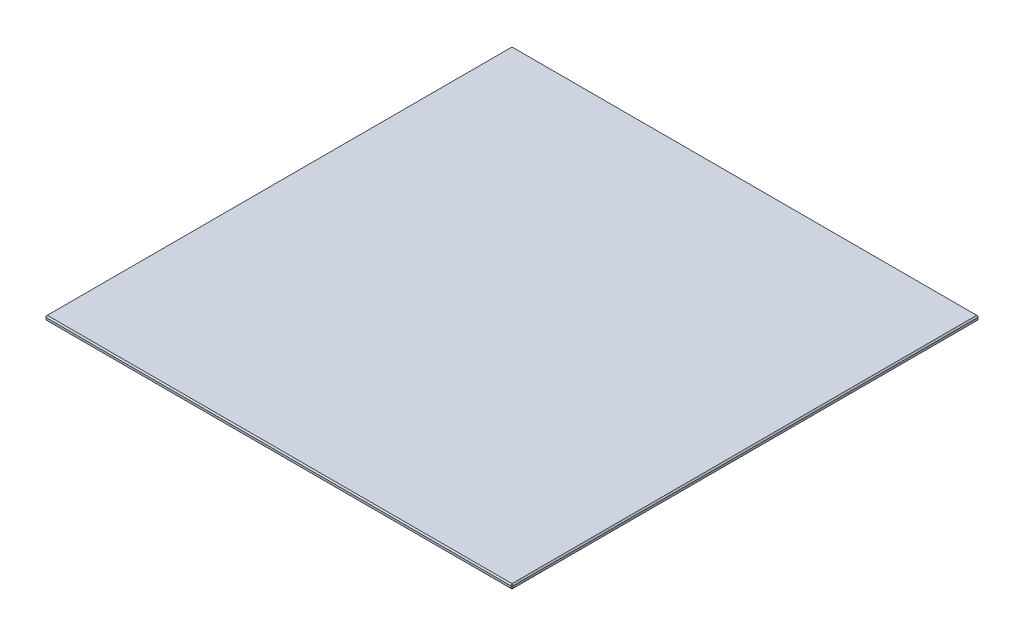
ISO-10303-21;
HEADER;
FILE_DESCRIPTION(('STEP AP214'),'2;1');
FILE_NAME('part.step','',(''),(''),'','','');
FILE_SCHEMA(('AUTOMOTIVE_DESIGN { 1 0 10303 214 1 1 1 1 }'));
ENDSEC;
DATA;
#1=APPLICATION_CONTEXT('core data for automotive mechanical design processes');
#2=APPLICATION_PROTOCOL_DEFINITION('international standard','automotive_design',2000,#1);
#3=PRODUCT_CONTEXT('',#1,'mechanical');
#4=PRODUCT('Part','Part','',(#3));
#5=PRODUCT_RELATED_PRODUCT_CATEGORY('part','',(#4));
#6=PRODUCT_DEFINITION_FORMATION('','',#4);
#7=PRODUCT_DEFINITION_CONTEXT('part definition',#1,'design');
#8=PRODUCT_DEFINITION('design','',#6,#7);
#9=PRODUCT_DEFINITION_SHAPE('','',#8);
#10=(LENGTH_UNIT() NAMED_UNIT(*) SI_UNIT(.MILLI.,.METRE.));
#11=(NAMED_UNIT(*) PLANE_ANGLE_UNIT() SI_UNIT($,.RADIAN.));
#12=(NAMED_UNIT(*) SI_UNIT($,.STERADIAN.) SOLID_ANGLE_UNIT());
#13=UNCERTAINTY_MEASURE_WITH_UNIT(LENGTH_MEASURE(1.E-05),#10,'distance_accuracy_value','');
#14=(GEOMETRIC_REPRESENTATION_CONTEXT(3) GLOBAL_UNCERTAINTY_ASSIGNED_CONTEXT((#13)) GLOBAL_UNIT_ASSIGNED_CONTEXT((#10,
#11,#12)) REPRESENTATION_CONTEXT('',''));
#15=CARTESIAN_POINT('',(0.,0.,0.));
#16=DIRECTION('',(0.,0.,1.));
#17=DIRECTION('',(1.,0.,0.));
#18=AXIS2_PLACEMENT_3D('',#15,#16,#17);
#19=CARTESIAN_POINT('',(-150.,3.,-150.));
#20=DIRECTION('',(1.,0.,0.));
#21=DIRECTION('',(0.,0.,-1.));
#22=AXIS2_PLACEMENT_3D('',#19,#20,#21);
#23=PLANE('',#22);
#24=DIRECTION('',(0.,0.,-1.));
#25=VECTOR('',#24,1.);
#26=CARTESIAN_POINT('',(-150.,2.19999999999998,-150.));
#27=LINE('',#26,#25);
#28=CARTESIAN_POINT('',(-150.,2.19999999999998,149.2));
#29=VERTEX_POINT('',#28);
#30=CARTESIAN_POINT('',(-150.,2.19999999999998,-149.2));
#31=VERTEX_POINT('',#30);
#32=EDGE_CURVE('E216',#29,#31,#27,.T.);
#33=ORIENTED_EDGE('',*,*,#32,.T.);
#34=DIRECTION('',(0.,-1.,0.));
#35=VECTOR('',#34,1.);
#36=CARTESIAN_POINT('',(-150.,3.,-149.2));
#37=LINE('',#36,#35);
#38=CARTESIAN_POINT('',(-150.,0.800000000000023,-149.2));
#39=VERTEX_POINT('',#38);
#40=EDGE_CURVE('E11',#31,#39,#37,.T.);
#41=ORIENTED_EDGE('',*,*,#40,.T.);
#42=DIRECTION('',(0.,0.,1.));
#43=VECTOR('',#42,1.);
#44=CARTESIAN_POINT('',(-150.,0.800000000000023,-150.));
#45=LINE('',#44,#43);
#46=CARTESIAN_POINT('',(-150.,0.800000000000023,149.2));
#47=VERTEX_POINT('',#46);
#48=EDGE_CURVE('E43',#39,#47,#45,.T.);
#49=ORIENTED_EDGE('',*,*,#48,.T.);
#50=DIRECTION('',(0.,1.,0.));
#51=VECTOR('',#50,1.);
#52=CARTESIAN_POINT('',(-150.,3.,149.2));
#53=LINE('',#52,#51);
#54=EDGE_CURVE('E241',#47,#29,#53,.T.);
#55=ORIENTED_EDGE('',*,*,#54,.T.);
#56=EDGE_LOOP('',(#33,#41,#49,#55));
#57=FACE_BOUND('',#56,.T.);
#58=ADVANCED_FACE('F34',(#57),#23,.F.);
#59=CARTESIAN_POINT('',(-150.,3.,150.));
#60=DIRECTION('',(0.,0.,-1.));
#61=DIRECTION('',(-1.,0.,0.));
#62=AXIS2_PLACEMENT_3D('',#59,#60,#61);
#63=PLANE('',#62);
#64=DIRECTION('',(1.,0.,0.));
#65=VECTOR('',#64,1.);
#66=CARTESIAN_POINT('',(-150.,0.800000000000023,150.));
#67=LINE('',#66,#65);
#68=CARTESIAN_POINT('',(-149.2,0.800000000000023,150.));
#69=VERTEX_POINT('',#68);
#70=CARTESIAN_POINT('',(149.2,0.800000000000023,150.));
#71=VERTEX_POINT('',#70);
#72=EDGE_CURVE('E275',#69,#71,#67,.T.);
#73=ORIENTED_EDGE('',*,*,#72,.T.);
#74=DIRECTION('',(0.,1.,0.));
#75=VECTOR('',#74,1.);
#76=CARTESIAN_POINT('',(149.2,3.,150.));
#77=LINE('',#76,#75);
#78=CARTESIAN_POINT('',(149.2,2.19999999999998,150.));
#79=VERTEX_POINT('',#78);
#80=EDGE_CURVE('E272',#71,#79,#77,.T.);
#81=ORIENTED_EDGE('',*,*,#80,.T.);
#82=DIRECTION('',(-1.,0.,0.));
#83=VECTOR('',#82,1.);
#84=CARTESIAN_POINT('',(-150.,2.19999999999998,150.));
#85=LINE('',#84,#83);
#86=CARTESIAN_POINT('',(-149.2,2.19999999999998,150.));
#87=VERTEX_POINT('',#86);
#88=EDGE_CURVE('E264',#79,#87,#85,.T.);
#89=ORIENTED_EDGE('',*,*,#88,.T.);
#90=DIRECTION('',(0.,-1.,0.));
#91=VECTOR('',#90,1.);
#92=CARTESIAN_POINT('',(-149.2,3.,150.));
#93=LINE('',#92,#91);
#94=EDGE_CURVE('E269',#87,#69,#93,.T.);
#95=ORIENTED_EDGE('',*,*,#94,.T.);
#96=EDGE_LOOP('',(#73,#81,#89,#95));
#97=FACE_BOUND('',#96,.T.);
#98=ADVANCED_FACE('F273',(#97),#63,.F.);
#99=CARTESIAN_POINT('',(150.,3.,-150.));
#100=DIRECTION('',(-1.,0.,0.));
#101=DIRECTION('',(0.,0.,1.));
#102=AXIS2_PLACEMENT_3D('',#99,#100,#101);
#103=PLANE('',#102);
#104=DIRECTION('',(0.,0.,1.));
#105=VECTOR('',#104,1.);
#106=CARTESIAN_POINT('',(150.,2.19999999999998,150.));
#107=LINE('',#106,#105);
#108=CARTESIAN_POINT('',(150.,2.19999999999998,-149.2));
#109=VERTEX_POINT('',#108);
#110=CARTESIAN_POINT('',(150.,2.19999999999998,149.2));
#111=VERTEX_POINT('',#110);
#112=EDGE_CURVE('E133',#109,#111,#107,.T.);
#113=ORIENTED_EDGE('',*,*,#112,.T.);
#114=DIRECTION('',(0.,-1.,0.));
#115=VECTOR('',#114,1.);
#116=CARTESIAN_POINT('',(150.,3.,149.2));
#117=LINE('',#116,#115);
#118=CARTESIAN_POINT('',(150.,0.800000000000023,149.2));
#119=VERTEX_POINT('',#118);
#120=EDGE_CURVE('E129',#111,#119,#117,.T.);
#121=ORIENTED_EDGE('',*,*,#120,.T.);
#122=DIRECTION('',(0.,0.,-1.));
#123=VECTOR('',#122,1.);
#124=CARTESIAN_POINT('',(150.,0.800000000000023,-150.));
#125=LINE('',#124,#123);
#126=CARTESIAN_POINT('',(150.,0.800000000000023,-149.2));
#127=VERTEX_POINT('',#126);
#128=EDGE_CURVE('E123',#119,#127,#125,.T.);
#129=ORIENTED_EDGE('',*,*,#128,.T.);
#130=DIRECTION('',(0.,1.,0.));
#131=VECTOR('',#130,1.);
#132=CARTESIAN_POINT('',(150.,3.,-149.2));
#133=LINE('',#132,#131);
#134=EDGE_CURVE('E126',#127,#109,#133,.T.);
#135=ORIENTED_EDGE('',*,*,#134,.T.);
#136=EDGE_LOOP('',(#113,#121,#129,#135));
#137=FACE_BOUND('',#136,.T.);
#138=ADVANCED_FACE('F125',(#137),#103,.F.);
#139=CARTESIAN_POINT('',(-150.,3.,-150.));
#140=DIRECTION('',(0.,0.,1.));
#141=DIRECTION('',(1.,0.,0.));
#142=AXIS2_PLACEMENT_3D('',#139,#140,#141);
#143=PLANE('',#142);
#144=DIRECTION('',(1.,0.,0.));
#145=VECTOR('',#144,1.);
#146=CARTESIAN_POINT('',(150.,2.19999999999998,-150.));
#147=LINE('',#146,#145);
#148=CARTESIAN_POINT('',(-149.2,2.19999999999998,-150.));
#149=VERTEX_POINT('',#148);
#150=CARTESIAN_POINT('',(149.2,2.19999999999998,-150.));
#151=VERTEX_POINT('',#150);
#152=EDGE_CURVE('E233',#149,#151,#147,.T.);
#153=ORIENTED_EDGE('',*,*,#152,.T.);
#154=DIRECTION('',(0.,-1.,0.));
#155=VECTOR('',#154,1.);
#156=CARTESIAN_POINT('',(149.2,3.,-150.));
#157=LINE('',#156,#155);
#158=CARTESIAN_POINT('',(149.2,0.800000000000023,-150.));
#159=VERTEX_POINT('',#158);
#160=EDGE_CURVE('E237',#151,#159,#157,.T.);
#161=ORIENTED_EDGE('',*,*,#160,.T.);
#162=DIRECTION('',(-1.,0.,0.));
#163=VECTOR('',#162,1.);
#164=CARTESIAN_POINT('',(-150.,0.800000000000023,-150.));
#165=LINE('',#164,#163);
#166=CARTESIAN_POINT('',(-149.2,0.800000000000023,-150.));
#167=VERTEX_POINT('',#166);
#168=EDGE_CURVE('E235',#159,#167,#165,.T.);
#169=ORIENTED_EDGE('',*,*,#168,.T.);
#170=DIRECTION('',(0.,1.,0.));
#171=VECTOR('',#170,1.);
#172=CARTESIAN_POINT('',(-149.2,3.,-150.));
#173=LINE('',#172,#171);
#174=EDGE_CURVE('E231',#167,#149,#173,.T.);
#175=ORIENTED_EDGE('',*,*,#174,.T.);
#176=EDGE_LOOP('',(#153,#161,#169,#175));
#177=FACE_BOUND('',#176,.T.);
#178=ADVANCED_FACE('F296',(#177),#143,.F.);
#179=CARTESIAN_POINT('',(0.,3.,0.));
#180=DIRECTION('',(0.,1.,0.));
#181=DIRECTION('',(0.,0.,1.));
#182=AXIS2_PLACEMENT_3D('',#179,#180,#181);
#183=PLANE('',#182);
#184=DIRECTION('',(1.,0.,0.));
#185=VECTOR('',#184,1.);
#186=CARTESIAN_POINT('',(150.,3.,149.2));
#187=LINE('',#186,#185);
#188=CARTESIAN_POINT('',(-149.2,3.,149.2));
#189=VERTEX_POINT('',#188);
#190=CARTESIAN_POINT('',(149.2,3.,149.2));
#191=VERTEX_POINT('',#190);
#192=EDGE_CURVE('E222',#189,#191,#187,.T.);
#193=ORIENTED_EDGE('',*,*,#192,.T.);
#194=DIRECTION('',(0.,0.,-1.));
#195=VECTOR('',#194,1.);
#196=CARTESIAN_POINT('',(149.2,3.,-150.));
#197=LINE('',#196,#195);
#198=CARTESIAN_POINT('',(149.2,3.,-149.2));
#199=VERTEX_POINT('',#198);
#200=EDGE_CURVE('E224',#191,#199,#197,.T.);
#201=ORIENTED_EDGE('',*,*,#200,.T.);
#202=DIRECTION('',(-1.,0.,0.));
#203=VECTOR('',#202,1.);
#204=CARTESIAN_POINT('',(-150.,3.,-149.2));
#205=LINE('',#204,#203);
#206=CARTESIAN_POINT('',(-149.2,3.,-149.2));
#207=VERTEX_POINT('',#206);
#208=EDGE_CURVE('E221',#199,#207,#205,.T.);
#209=ORIENTED_EDGE('',*,*,#208,.T.);
#210=DIRECTION('',(0.,0.,1.));
#211=VECTOR('',#210,1.);
#212=CARTESIAN_POINT('',(-149.2,3.,150.));
#213=LINE('',#212,#211);
#214=EDGE_CURVE('E218',#207,#189,#213,.T.);
#215=ORIENTED_EDGE('',*,*,#214,.T.);
#216=EDGE_LOOP('',(#193,#201,#209,#215));
#217=FACE_BOUND('',#216,.T.);
#218=ADVANCED_FACE('F337',(#217),#183,.T.);
#219=CARTESIAN_POINT('',(0.,0.,0.));
#220=DIRECTION('',(0.,1.,0.));
#221=DIRECTION('',(0.,0.,1.));
#222=AXIS2_PLACEMENT_3D('',#219,#220,#221);
#223=PLANE('',#222);
#224=DIRECTION('',(1.,0.,0.));
#225=VECTOR('',#224,1.);
#226=CARTESIAN_POINT('',(0.,0.,-149.2));
#227=LINE('',#226,#225);
#228=CARTESIAN_POINT('',(-149.2,0.,-149.2));
#229=VERTEX_POINT('',#228);
#230=CARTESIAN_POINT('',(149.2,0.,-149.2));
#231=VERTEX_POINT('',#230);
#232=EDGE_CURVE('E287',#229,#231,#227,.T.);
#233=ORIENTED_EDGE('',*,*,#232,.T.);
#234=DIRECTION('',(0.,0.,1.));
#235=VECTOR('',#234,1.);
#236=CARTESIAN_POINT('',(149.2,0.,0.));
#237=LINE('',#236,#235);
#238=CARTESIAN_POINT('',(149.2,0.,149.2));
#239=VERTEX_POINT('',#238);
#240=EDGE_CURVE('E156',#231,#239,#237,.T.);
#241=ORIENTED_EDGE('',*,*,#240,.T.);
#242=DIRECTION('',(-1.,0.,0.));
#243=VECTOR('',#242,1.);
#244=CARTESIAN_POINT('',(0.,0.,149.2));
#245=LINE('',#244,#243);
#246=CARTESIAN_POINT('',(-149.2,0.,149.2));
#247=VERTEX_POINT('',#246);
#248=EDGE_CURVE('E279',#239,#247,#245,.T.);
#249=ORIENTED_EDGE('',*,*,#248,.T.);
#250=DIRECTION('',(0.,0.,-1.));
#251=VECTOR('',#250,1.);
#252=CARTESIAN_POINT('',(-149.2,0.,0.));
#253=LINE('',#252,#251);
#254=EDGE_CURVE('E281',#247,#229,#253,.T.);
#255=ORIENTED_EDGE('',*,*,#254,.T.);
#256=EDGE_LOOP('',(#233,#241,#249,#255));
#257=FACE_BOUND('',#256,.T.);
#258=ADVANCED_FACE('F289',(#257),#223,.F.);
#259=CARTESIAN_POINT('',(-150.,3.,-149.2));
#260=DIRECTION('',(0.707106781186548,0.,0.707106781186548));
#261=DIRECTION('',(0.,-1.,0.));
#262=AXIS2_PLACEMENT_3D('',#259,#260,#261);
#263=PLANE('',#262);
#264=DIRECTION('',(0.707106781186548,0.,-0.707106781186548));
#265=VECTOR('',#264,1.);
#266=CARTESIAN_POINT('',(-149.6,2.19999999999998,-149.6));
#267=LINE('',#266,#265);
#268=EDGE_CURVE('E38',#149,#31,#267,.F.);
#269=ORIENTED_EDGE('',*,*,#268,.F.);
#270=ORIENTED_EDGE('',*,*,#174,.F.);
#271=DIRECTION('',(-0.707106781186548,0.,0.707106781186548));
#272=VECTOR('',#271,1.);
#273=CARTESIAN_POINT('',(-149.2,0.800000000000023,-150.));
#274=LINE('',#273,#272);
#275=EDGE_CURVE('E196',#39,#167,#274,.F.);
#276=ORIENTED_EDGE('',*,*,#275,.F.);
#277=ORIENTED_EDGE('',*,*,#40,.F.);
#278=EDGE_LOOP('',(#269,#270,#276,#277));
#279=FACE_BOUND('',#278,.T.);
#280=ADVANCED_FACE('F36',(#279),#263,.F.);
#281=CARTESIAN_POINT('',(-149.2,3.,-149.2));
#282=DIRECTION('',(-0.577350269189626,0.577350269189626,-0.577350269189626));
#283=DIRECTION('',(-0.707106781186547,0.,0.707106781186547));
#284=AXIS2_PLACEMENT_3D('',#281,#282,#283);
#285=PLANE('',#284);
#286=DIRECTION('',(0.,-0.707106781186554,-0.707106781186541));
#287=VECTOR('',#286,1.);
#288=CARTESIAN_POINT('',(-149.2,3.00000000000001,-149.2));
#289=LINE('',#288,#287);
#290=EDGE_CURVE('E191',#149,#207,#289,.F.);
#291=ORIENTED_EDGE('',*,*,#290,.F.);
#292=ORIENTED_EDGE('',*,*,#268,.T.);
#293=DIRECTION('',(0.707106781186548,0.707106781186548,0.));
#294=VECTOR('',#293,1.);
#295=CARTESIAN_POINT('',(-149.2,3.,-149.2));
#296=LINE('',#295,#294);
#297=EDGE_CURVE('E194',#207,#31,#296,.F.);
#298=ORIENTED_EDGE('',*,*,#297,.F.);
#299=EDGE_LOOP('',(#291,#292,#298));
#300=FACE_BOUND('',#299,.T.);
#301=ADVANCED_FACE('F206',(#300),#285,.T.);
#302=CARTESIAN_POINT('',(-149.2,0.800000000000023,-150.));
#303=DIRECTION('',(-0.577350269189633,-0.577350269189612,-0.577350269189633));
#304=DIRECTION('',(-0.707106781186547,0.,0.707106781186547));
#305=AXIS2_PLACEMENT_3D('',#302,#303,#304);
#306=PLANE('',#305);
#307=DIRECTION('',(0.707106781186547,-0.707106781186547,0.));
#308=VECTOR('',#307,1.);
#309=CARTESIAN_POINT('',(-149.6,0.399999999999998,-149.2));
#310=LINE('',#309,#308);
#311=EDGE_CURVE('E186',#39,#229,#310,.T.);
#312=ORIENTED_EDGE('',*,*,#311,.F.);
#313=ORIENTED_EDGE('',*,*,#275,.T.);
#314=DIRECTION('',(0.,0.707106781186554,-0.707106781186541));
#315=VECTOR('',#314,1.);
#316=CARTESIAN_POINT('',(-149.2,0.800000000000023,-150.));
#317=LINE('',#316,#315);
#318=EDGE_CURVE('E188',#229,#167,#317,.T.);
#319=ORIENTED_EDGE('',*,*,#318,.F.);
#320=EDGE_LOOP('',(#312,#313,#319));
#321=FACE_BOUND('',#320,.T.);
#322=ADVANCED_FACE('F360',(#321),#306,.T.);
#323=CARTESIAN_POINT('',(-149.2,3.,0.));
#324=DIRECTION('',(-0.707106781186548,0.707106781186548,0.));
#325=DIRECTION('',(0.,0.,-1.));
#326=AXIS2_PLACEMENT_3D('',#323,#324,#325);
#327=PLANE('',#326);
#328=ORIENTED_EDGE('',*,*,#297,.T.);
#329=ORIENTED_EDGE('',*,*,#32,.F.);
#330=DIRECTION('',(-0.707106781186548,-0.707106781186548,0.));
#331=VECTOR('',#330,1.);
#332=CARTESIAN_POINT('',(-150.,2.19999999999998,149.2));
#333=LINE('',#332,#331);
#334=EDGE_CURVE('E180',#189,#29,#333,.T.);
#335=ORIENTED_EDGE('',*,*,#334,.F.);
#336=ORIENTED_EDGE('',*,*,#214,.F.);
#337=EDGE_LOOP('',(#328,#329,#335,#336));
#338=FACE_BOUND('',#337,.T.);
#339=ADVANCED_FACE('F214',(#338),#327,.T.);
#340=CARTESIAN_POINT('',(0.,3.,-149.2));
#341=DIRECTION('',(0.,0.707106781186541,-0.707106781186554));
#342=DIRECTION('',(1.,0.,0.));
#343=AXIS2_PLACEMENT_3D('',#340,#341,#342);
#344=PLANE('',#343);
#345=ORIENTED_EDGE('',*,*,#290,.T.);
#346=ORIENTED_EDGE('',*,*,#208,.F.);
#347=DIRECTION('',(0.,0.707106781186554,0.707106781186541));
#348=VECTOR('',#347,1.);
#349=CARTESIAN_POINT('',(149.2,3.00000000000001,-149.2));
#350=LINE('',#349,#348);
#351=EDGE_CURVE('E177',#151,#199,#350,.T.);
#352=ORIENTED_EDGE('',*,*,#351,.F.);
#353=ORIENTED_EDGE('',*,*,#152,.F.);
#354=EDGE_LOOP('',(#345,#346,#352,#353));
#355=FACE_BOUND('',#354,.T.);
#356=ADVANCED_FACE('F300',(#355),#344,.T.);
#357=CARTESIAN_POINT('',(149.2,3.,-150.));
#358=DIRECTION('',(-0.707106781186548,0.,0.707106781186548));
#359=DIRECTION('',(0.,-1.,0.));
#360=AXIS2_PLACEMENT_3D('',#357,#358,#359);
#361=PLANE('',#360);
#362=DIRECTION('',(-0.707106781186548,0.,-0.707106781186548));
#363=VECTOR('',#362,1.);
#364=CARTESIAN_POINT('',(150.,0.800000000000023,-149.2));
#365=LINE('',#364,#363);
#366=EDGE_CURVE('E140',#159,#127,#365,.F.);
#367=ORIENTED_EDGE('',*,*,#366,.F.);
#368=ORIENTED_EDGE('',*,*,#160,.F.);
#369=DIRECTION('',(0.707106781186548,0.,0.707106781186548));
#370=VECTOR('',#369,1.);
#371=CARTESIAN_POINT('',(149.6,2.19999999999998,-149.6));
#372=LINE('',#371,#370);
#373=EDGE_CURVE('E143',#109,#151,#372,.F.);
#374=ORIENTED_EDGE('',*,*,#373,.F.);
#375=ORIENTED_EDGE('',*,*,#134,.F.);
#376=EDGE_LOOP('',(#367,#368,#374,#375));
#377=FACE_BOUND('',#376,.T.);
#378=ADVANCED_FACE('F138',(#377),#361,.F.);
#379=CARTESIAN_POINT('',(-150.,0.800000000000023,-150.));
#380=DIRECTION('',(0.,0.707106781186541,0.707106781186554));
#381=DIRECTION('',(-1.,0.,0.));
#382=AXIS2_PLACEMENT_3D('',#379,#380,#381);
#383=PLANE('',#382);
#384=ORIENTED_EDGE('',*,*,#318,.T.);
#385=ORIENTED_EDGE('',*,*,#168,.F.);
#386=DIRECTION('',(0.,-0.707106781186554,0.707106781186541));
#387=VECTOR('',#386,1.);
#388=CARTESIAN_POINT('',(149.2,0.400000000000018,-149.6));
#389=LINE('',#388,#387);
#390=EDGE_CURVE('E152',#231,#159,#389,.F.);
#391=ORIENTED_EDGE('',*,*,#390,.F.);
#392=ORIENTED_EDGE('',*,*,#232,.F.);
#393=EDGE_LOOP('',(#384,#385,#391,#392));
#394=FACE_BOUND('',#393,.T.);
#395=ADVANCED_FACE('F294',(#394),#383,.F.);
#396=CARTESIAN_POINT('',(-150.,0.800000000000023,-150.));
#397=DIRECTION('',(0.707106781186548,0.707106781186548,0.));
#398=DIRECTION('',(0.,0.,1.));
#399=AXIS2_PLACEMENT_3D('',#396,#397,#398);
#400=PLANE('',#399);
#401=ORIENTED_EDGE('',*,*,#311,.T.);
#402=ORIENTED_EDGE('',*,*,#254,.F.);
#403=DIRECTION('',(-0.707106781186548,0.707106781186548,0.));
#404=VECTOR('',#403,1.);
#405=CARTESIAN_POINT('',(-150.,0.800000000000023,149.2));
#406=LINE('',#405,#404);
#407=EDGE_CURVE('E172',#47,#247,#406,.F.);
#408=ORIENTED_EDGE('',*,*,#407,.F.);
#409=ORIENTED_EDGE('',*,*,#48,.F.);
#410=EDGE_LOOP('',(#401,#402,#408,#409));
#411=FACE_BOUND('',#410,.T.);
#412=ADVANCED_FACE('F390',(#411),#400,.F.);
#413=CARTESIAN_POINT('',(-149.2,3.,150.));
#414=DIRECTION('',(0.70710678118656,0.,-0.707106781186535));
#415=DIRECTION('',(0.,-1.,0.));
#416=AXIS2_PLACEMENT_3D('',#413,#414,#415);
#417=PLANE('',#416);
#418=DIRECTION('',(-0.707106781186535,0.,-0.70710678118656));
#419=VECTOR('',#418,1.);
#420=CARTESIAN_POINT('',(-150.,2.19999999999998,149.2));
#421=LINE('',#420,#419);
#422=EDGE_CURVE('E183',#29,#87,#421,.F.);
#423=ORIENTED_EDGE('',*,*,#422,.F.);
#424=ORIENTED_EDGE('',*,*,#54,.F.);
#425=DIRECTION('',(0.707106781186535,0.,0.70710678118656));
#426=VECTOR('',#425,1.);
#427=CARTESIAN_POINT('',(-150.,0.800000000000023,149.2));
#428=LINE('',#427,#426);
#429=EDGE_CURVE('E169',#69,#47,#428,.F.);
#430=ORIENTED_EDGE('',*,*,#429,.F.);
#431=ORIENTED_EDGE('',*,*,#94,.F.);
#432=EDGE_LOOP('',(#423,#424,#430,#431));
#433=FACE_BOUND('',#432,.T.);
#434=ADVANCED_FACE('F312',(#433),#417,.F.);
#435=CARTESIAN_POINT('',(-150.,2.19999999999998,149.2));
#436=DIRECTION('',(-0.577350269189639,0.577350269189619,0.577350269189619));
#437=DIRECTION('',(0.707106781186535,0.,0.70710678118656));
#438=AXIS2_PLACEMENT_3D('',#435,#436,#437);
#439=PLANE('',#438);
#440=ORIENTED_EDGE('',*,*,#334,.T.);
#441=ORIENTED_EDGE('',*,*,#422,.T.);
#442=DIRECTION('',(0.,0.707106781186547,-0.707106781186547));
#443=VECTOR('',#442,1.);
#444=CARTESIAN_POINT('',(-149.2,2.6,149.6));
#445=LINE('',#444,#443);
#446=EDGE_CURVE('E160',#189,#87,#445,.F.);
#447=ORIENTED_EDGE('',*,*,#446,.F.);
#448=EDGE_LOOP('',(#440,#441,#447));
#449=FACE_BOUND('',#448,.T.);
#450=ADVANCED_FACE('F403',(#449),#439,.T.);
#451=CARTESIAN_POINT('',(149.2,3.,-149.2));
#452=DIRECTION('',(0.577350269189626,0.577350269189626,-0.577350269189626));
#453=DIRECTION('',(-0.707106781186547,0.,-0.707106781186547));
#454=AXIS2_PLACEMENT_3D('',#451,#452,#453);
#455=PLANE('',#454);
#456=ORIENTED_EDGE('',*,*,#373,.T.);
#457=ORIENTED_EDGE('',*,*,#351,.T.);
#458=DIRECTION('',(0.707106781186554,-0.707106781186541,0.));
#459=VECTOR('',#458,1.);
#460=CARTESIAN_POINT('',(149.2,2.99999999999999,-149.2));
#461=LINE('',#460,#459);
#462=EDGE_CURVE('E157',#109,#199,#461,.F.);
#463=ORIENTED_EDGE('',*,*,#462,.F.);
#464=EDGE_LOOP('',(#456,#457,#463));
#465=FACE_BOUND('',#464,.T.);
#466=ADVANCED_FACE('F302',(#465),#455,.T.);
#467=CARTESIAN_POINT('',(150.,0.800000000000023,-149.2));
#468=DIRECTION('',(0.577350269189626,-0.577350269189626,-0.577350269189626));
#469=DIRECTION('',(-0.707106781186547,0.,-0.707106781186547));
#470=AXIS2_PLACEMENT_3D('',#467,#468,#469);
#471=PLANE('',#470);
#472=ORIENTED_EDGE('',*,*,#390,.T.);
#473=ORIENTED_EDGE('',*,*,#366,.T.);
#474=DIRECTION('',(0.707106781186554,0.707106781186541,0.));
#475=VECTOR('',#474,1.);
#476=CARTESIAN_POINT('',(150.,0.800000000000023,-149.2));
#477=LINE('',#476,#475);
#478=EDGE_CURVE('E149',#231,#127,#477,.T.);
#479=ORIENTED_EDGE('',*,*,#478,.F.);
#480=EDGE_LOOP('',(#472,#473,#479));
#481=FACE_BOUND('',#480,.T.);
#482=ADVANCED_FACE('F148',(#481),#471,.T.);
#483=CARTESIAN_POINT('',(-150.,0.800000000000023,149.2));
#484=DIRECTION('',(-0.577350269189639,-0.577350269189619,0.577350269189619));
#485=DIRECTION('',(0.707106781186535,0.,0.70710678118656));
#486=AXIS2_PLACEMENT_3D('',#483,#484,#485);
#487=PLANE('',#486);
#488=ORIENTED_EDGE('',*,*,#429,.T.);
#489=ORIENTED_EDGE('',*,*,#407,.T.);
#490=DIRECTION('',(0.,-0.707106781186547,-0.707106781186547));
#491=VECTOR('',#490,1.);
#492=CARTESIAN_POINT('',(-149.2,0.399999999999998,149.6));
#493=LINE('',#492,#491);
#494=EDGE_CURVE('E158',#69,#247,#493,.T.);
#495=ORIENTED_EDGE('',*,*,#494,.F.);
#496=EDGE_LOOP('',(#488,#489,#495));
#497=FACE_BOUND('',#496,.T.);
#498=ADVANCED_FACE('F314',(#497),#487,.T.);
#499=CARTESIAN_POINT('',(0.,3.,149.2));
#500=DIRECTION('',(0.,0.707106781186548,0.707106781186548));
#501=DIRECTION('',(-1.,0.,0.));
#502=AXIS2_PLACEMENT_3D('',#499,#500,#501);
#503=PLANE('',#502);
#504=ORIENTED_EDGE('',*,*,#446,.T.);
#505=ORIENTED_EDGE('',*,*,#88,.F.);
#506=DIRECTION('',(0.,-0.707106781186548,0.707106781186548));
#507=VECTOR('',#506,1.);
#508=CARTESIAN_POINT('',(149.2,2.19999999999998,150.));
#509=LINE('',#508,#507);
#510=EDGE_CURVE('E163',#191,#79,#509,.T.);
#511=ORIENTED_EDGE('',*,*,#510,.F.);
#512=ORIENTED_EDGE('',*,*,#192,.F.);
#513=EDGE_LOOP('',(#504,#505,#511,#512));
#514=FACE_BOUND('',#513,.T.);
#515=ADVANCED_FACE('F266',(#514),#503,.T.);
#516=CARTESIAN_POINT('',(149.2,3.,0.));
#517=DIRECTION('',(0.707106781186541,0.707106781186554,0.));
#518=DIRECTION('',(0.,0.,1.));
#519=AXIS2_PLACEMENT_3D('',#516,#517,#518);
#520=PLANE('',#519);
#521=ORIENTED_EDGE('',*,*,#462,.T.);
#522=ORIENTED_EDGE('',*,*,#200,.F.);
#523=DIRECTION('',(-0.707106781186554,0.707106781186541,0.));
#524=VECTOR('',#523,1.);
#525=CARTESIAN_POINT('',(149.6,2.60000000000001,149.2));
#526=LINE('',#525,#524);
#527=EDGE_CURVE('E253',#111,#191,#526,.T.);
#528=ORIENTED_EDGE('',*,*,#527,.F.);
#529=ORIENTED_EDGE('',*,*,#112,.F.);
#530=EDGE_LOOP('',(#521,#522,#528,#529));
#531=FACE_BOUND('',#530,.T.);
#532=ADVANCED_FACE('F306',(#531),#520,.T.);
#533=CARTESIAN_POINT('',(150.,0.800000000000023,-150.));
#534=DIRECTION('',(-0.707106781186541,0.707106781186554,0.));
#535=DIRECTION('',(0.,0.,-1.));
#536=AXIS2_PLACEMENT_3D('',#533,#534,#535);
#537=PLANE('',#536);
#538=ORIENTED_EDGE('',*,*,#478,.T.);
#539=ORIENTED_EDGE('',*,*,#128,.F.);
#540=DIRECTION('',(-0.707106781186554,-0.707106781186541,0.));
#541=VECTOR('',#540,1.);
#542=CARTESIAN_POINT('',(150.,0.800000000000023,149.2));
#543=LINE('',#542,#541);
#544=EDGE_CURVE('E250',#239,#119,#543,.F.);
#545=ORIENTED_EDGE('',*,*,#544,.F.);
#546=ORIENTED_EDGE('',*,*,#240,.F.);
#547=EDGE_LOOP('',(#538,#539,#545,#546));
#548=FACE_BOUND('',#547,.T.);
#549=ADVANCED_FACE('F154',(#548),#537,.F.);
#550=CARTESIAN_POINT('',(-150.,0.800000000000023,150.));
#551=DIRECTION('',(0.,0.707106781186548,-0.707106781186548));
#552=DIRECTION('',(1.,0.,0.));
#553=AXIS2_PLACEMENT_3D('',#550,#551,#552);
#554=PLANE('',#553);
#555=ORIENTED_EDGE('',*,*,#494,.T.);
#556=ORIENTED_EDGE('',*,*,#248,.F.);
#557=DIRECTION('',(0.,0.707106781186548,0.707106781186548));
#558=VECTOR('',#557,1.);
#559=CARTESIAN_POINT('',(149.2,0.400000000000011,149.6));
#560=LINE('',#559,#558);
#561=EDGE_CURVE('E248',#71,#239,#560,.F.);
#562=ORIENTED_EDGE('',*,*,#561,.F.);
#563=ORIENTED_EDGE('',*,*,#72,.F.);
#564=EDGE_LOOP('',(#555,#556,#562,#563));
#565=FACE_BOUND('',#564,.T.);
#566=ADVANCED_FACE('F316',(#565),#554,.F.);
#567=CARTESIAN_POINT('',(149.2,2.19999999999998,150.));
#568=DIRECTION('',(0.577350269189619,0.577350269189619,0.577350269189639));
#569=DIRECTION('',(0.70710678118656,0.,-0.707106781186535));
#570=AXIS2_PLACEMENT_3D('',#567,#568,#569);
#571=PLANE('',#570);
#572=ORIENTED_EDGE('',*,*,#527,.T.);
#573=ORIENTED_EDGE('',*,*,#510,.T.);
#574=DIRECTION('',(-0.70710678118656,0.,0.707106781186535));
#575=VECTOR('',#574,1.);
#576=CARTESIAN_POINT('',(149.2,2.19999999999998,150.));
#577=LINE('',#576,#575);
#578=EDGE_CURVE('E246',#111,#79,#577,.T.);
#579=ORIENTED_EDGE('',*,*,#578,.F.);
#580=EDGE_LOOP('',(#572,#573,#579));
#581=FACE_BOUND('',#580,.T.);
#582=ADVANCED_FACE('F260',(#581),#571,.T.);
#583=CARTESIAN_POINT('',(150.,0.800000000000023,149.2));
#584=DIRECTION('',(0.577350269189612,-0.577350269189633,0.577350269189633));
#585=DIRECTION('',(0.,-0.707106781186547,-0.707106781186547));
#586=AXIS2_PLACEMENT_3D('',#583,#584,#585);
#587=PLANE('',#586);
#588=ORIENTED_EDGE('',*,*,#561,.T.);
#589=ORIENTED_EDGE('',*,*,#544,.T.);
#590=DIRECTION('',(0.70710678118656,0.,-0.707106781186535));
#591=VECTOR('',#590,1.);
#592=CARTESIAN_POINT('',(150.,0.800000000000023,149.2));
#593=LINE('',#592,#591);
#594=EDGE_CURVE('E244',#71,#119,#593,.T.);
#595=ORIENTED_EDGE('',*,*,#594,.F.);
#596=EDGE_LOOP('',(#588,#589,#595));
#597=FACE_BOUND('',#596,.T.);
#598=ADVANCED_FACE('F318',(#597),#587,.T.);
#599=CARTESIAN_POINT('',(150.,3.,149.2));
#600=DIRECTION('',(-0.707106781186535,0.,-0.70710678118656));
#601=DIRECTION('',(0.,-1.,0.));
#602=AXIS2_PLACEMENT_3D('',#599,#600,#601);
#603=PLANE('',#602);
#604=ORIENTED_EDGE('',*,*,#578,.T.);
#605=ORIENTED_EDGE('',*,*,#80,.F.);
#606=ORIENTED_EDGE('',*,*,#594,.T.);
#607=ORIENTED_EDGE('',*,*,#120,.F.);
#608=EDGE_LOOP('',(#604,#605,#606,#607));
#609=FACE_BOUND('',#608,.T.);
#610=ADVANCED_FACE('F319',(#609),#603,.F.);
#611=CLOSED_SHELL('',(#58,#98,#138,#178,#218,#258,#280,#301,#322,#339,#356,#378,#395,#412,#434,
#450,#466,#482,#498,#515,#532,#549,#566,#582,#598,#610));
#612=MANIFOLD_SOLID_BREP('B2',#611);
#613=ADVANCED_BREP_SHAPE_REPRESENTATION('',(#18,#612),#14);
#614=SHAPE_DEFINITION_REPRESENTATION(#9,#613);
ENDSEC;
END-ISO-10303-21;
